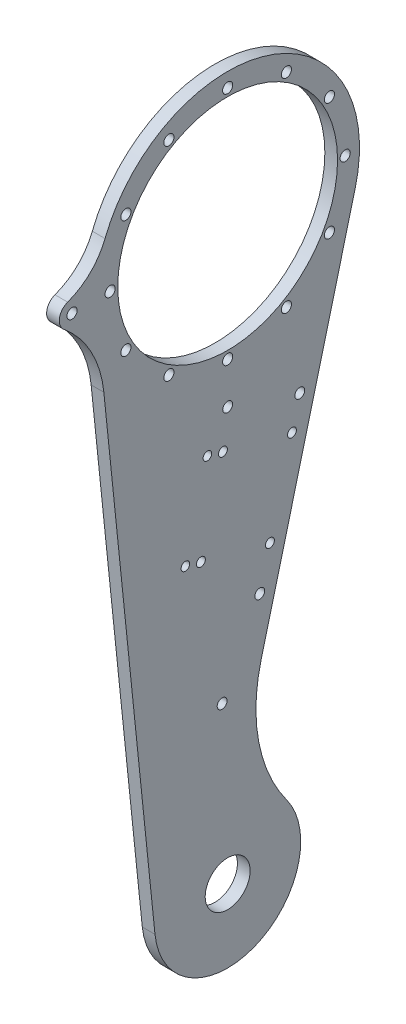
ISO-10303-21;
HEADER;
FILE_DESCRIPTION(('STEP AP214'),'2;1');
FILE_NAME('part.step','',(''),(''),'','','');
FILE_SCHEMA(('AUTOMOTIVE_DESIGN { 1 0 10303 214 1 1 1 1 }'));
ENDSEC;
DATA;
#1=APPLICATION_CONTEXT('core data for automotive mechanical design processes');
#2=APPLICATION_PROTOCOL_DEFINITION('international standard','automotive_design',2000,#1);
#3=PRODUCT_CONTEXT('',#1,'mechanical');
#4=PRODUCT('Part','Part','',(#3));
#5=PRODUCT_RELATED_PRODUCT_CATEGORY('part','',(#4));
#6=PRODUCT_DEFINITION_FORMATION('','',#4);
#7=PRODUCT_DEFINITION_CONTEXT('part definition',#1,'design');
#8=PRODUCT_DEFINITION('design','',#6,#7);
#9=PRODUCT_DEFINITION_SHAPE('','',#8);
#10=(LENGTH_UNIT() NAMED_UNIT(*) SI_UNIT(.MILLI.,.METRE.));
#11=(NAMED_UNIT(*) PLANE_ANGLE_UNIT() SI_UNIT($,.RADIAN.));
#12=(NAMED_UNIT(*) SI_UNIT($,.STERADIAN.) SOLID_ANGLE_UNIT());
#13=UNCERTAINTY_MEASURE_WITH_UNIT(LENGTH_MEASURE(1.E-05),#10,'distance_accuracy_value','');
#14=(GEOMETRIC_REPRESENTATION_CONTEXT(3) GLOBAL_UNCERTAINTY_ASSIGNED_CONTEXT((#13)) GLOBAL_UNIT_ASSIGNED_CONTEXT((#10,
#11,#12)) REPRESENTATION_CONTEXT('',''));
#15=CARTESIAN_POINT('',(0.,0.,0.));
#16=DIRECTION('',(0.,0.,1.));
#17=DIRECTION('',(1.,0.,0.));
#18=AXIS2_PLACEMENT_3D('',#15,#16,#17);
#19=CARTESIAN_POINT('',(4.,0.,0.));
#20=DIRECTION('',(-1.,0.,0.));
#21=DIRECTION('',(0.,0.,1.));
#22=AXIS2_PLACEMENT_3D('',#19,#20,#21);
#23=CYLINDRICAL_SURFACE('',#22,41.5);
#24=CARTESIAN_POINT('',(0.,0.,0.));
#25=DIRECTION('',(1.,0.,0.));
#26=DIRECTION('',(0.,0.,-1.));
#27=AXIS2_PLACEMENT_3D('',#24,#25,#26);
#28=CIRCLE('',#27,41.5);
#29=CARTESIAN_POINT('',(0.,-10.4614742427474,-40.1597753562982));
#30=VERTEX_POINT('',#29);
#31=CARTESIAN_POINT('',(0.,15.2163837891719,38.6097353575575));
#32=VERTEX_POINT('',#31);
#33=EDGE_CURVE('E128',#30,#32,#28,.T.);
#34=ORIENTED_EDGE('',*,*,#33,.T.);
#35=DIRECTION('',(-1.,0.,0.));
#36=VECTOR('',#35,1.);
#37=CARTESIAN_POINT('',(4.,15.2163837891719,38.6097353575575));
#38=LINE('',#37,#36);
#39=CARTESIAN_POINT('',(4.,15.2163837891719,38.6097353575575));
#40=VERTEX_POINT('',#39);
#41=EDGE_CURVE('E146',#32,#40,#38,.F.);
#42=ORIENTED_EDGE('',*,*,#41,.T.);
#43=CARTESIAN_POINT('',(4.,0.,0.));
#44=DIRECTION('',(1.,0.,0.));
#45=DIRECTION('',(0.,0.,-1.));
#46=AXIS2_PLACEMENT_3D('',#43,#44,#45);
#47=CIRCLE('',#46,41.5);
#48=CARTESIAN_POINT('',(4.,-10.4614742427474,-40.1597753562982));
#49=VERTEX_POINT('',#48);
#50=EDGE_CURVE('E107',#49,#40,#47,.T.);
#51=ORIENTED_EDGE('',*,*,#50,.F.);
#52=DIRECTION('',(-1.,0.,0.));
#53=VECTOR('',#52,1.);
#54=CARTESIAN_POINT('',(4.,-10.4614742427474,-40.1597753562982));
#55=LINE('',#54,#53);
#56=EDGE_CURVE('E117',#49,#30,#55,.T.);
#57=ORIENTED_EDGE('',*,*,#56,.T.);
#58=EDGE_LOOP('',(#34,#42,#51,#57));
#59=FACE_BOUND('',#58,.T.);
#60=ADVANCED_FACE('F36',(#59),#23,.T.);
#61=CARTESIAN_POINT('',(4.,-4.26527777777777,41.2802302013736));
#62=DIRECTION('',(0.,0.102777777777778,-0.994704342201773));
#63=DIRECTION('',(0.,0.994704342201773,0.102777777777778));
#64=AXIS2_PLACEMENT_3D('',#61,#62,#63);
#65=PLANE('',#64);
#66=DIRECTION('',(0.,-0.994704342201773,-0.102777777777778));
#67=VECTOR('',#66,1.);
#68=CARTESIAN_POINT('',(4.,-4.26527777777777,41.2802302013736));
#69=LINE('',#68,#67);
#70=CARTESIAN_POINT('',(4.,-26.5043971550649,38.982374273377));
#71=VERTEX_POINT('',#70);
#72=CARTESIAN_POINT('',(4.,-182.363888888889,22.8781998706408));
#73=VERTEX_POINT('',#72);
#74=EDGE_CURVE('E99',#71,#73,#69,.T.);
#75=ORIENTED_EDGE('',*,*,#74,.F.);
#76=DIRECTION('',(1.,0.,0.));
#77=VECTOR('',#76,1.);
#78=CARTESIAN_POINT('',(4.,-26.5043971550649,38.982374273377));
#79=LINE('',#78,#77);
#80=CARTESIAN_POINT('',(0.,-26.5043971550649,38.982374273377));
#81=VERTEX_POINT('',#80);
#82=EDGE_CURVE('E59',#71,#81,#79,.F.);
#83=ORIENTED_EDGE('',*,*,#82,.T.);
#84=DIRECTION('',(0.,-0.994704342201773,-0.102777777777778));
#85=VECTOR('',#84,1.);
#86=CARTESIAN_POINT('',(0.,-4.26527777777777,41.2802302013736));
#87=LINE('',#86,#85);
#88=CARTESIAN_POINT('',(0.,-182.363888888889,22.8781998706408));
#89=VERTEX_POINT('',#88);
#90=EDGE_CURVE('E112',#81,#89,#87,.T.);
#91=ORIENTED_EDGE('',*,*,#90,.T.);
#92=DIRECTION('',(-1.,0.,0.));
#93=VECTOR('',#92,1.);
#94=CARTESIAN_POINT('',(4.,-182.363888888889,22.8781998706408));
#95=LINE('',#94,#93);
#96=EDGE_CURVE('E110',#73,#89,#95,.T.);
#97=ORIENTED_EDGE('',*,*,#96,.F.);
#98=EDGE_LOOP('',(#75,#83,#91,#97));
#99=FACE_BOUND('',#98,.T.);
#100=ADVANCED_FACE('F111',(#99),#65,.F.);
#101=CARTESIAN_POINT('',(4.,-180.,0.));
#102=DIRECTION('',(-1.,0.,0.));
#103=DIRECTION('',(0.,0.,1.));
#104=AXIS2_PLACEMENT_3D('',#101,#102,#103);
#105=CYLINDRICAL_SURFACE('',#104,23.);
#106=CARTESIAN_POINT('',(0.,-180.,0.));
#107=DIRECTION('',(1.,0.,0.));
#108=DIRECTION('',(0.,0.,-1.));
#109=AXIS2_PLACEMENT_3D('',#106,#107,#108);
#110=CIRCLE('',#109,23.);
#111=CARTESIAN_POINT('',(0.,-166.412012387865,-18.5571170350483));
#112=VERTEX_POINT('',#111);
#113=EDGE_CURVE('E133',#89,#112,#110,.T.);
#114=ORIENTED_EDGE('',*,*,#113,.T.);
#115=DIRECTION('',(-1.,0.,0.));
#116=VECTOR('',#115,1.);
#117=CARTESIAN_POINT('',(4.,-166.412012387865,-18.5571170350483));
#118=LINE('',#117,#116);
#119=CARTESIAN_POINT('',(4.,-166.412012387865,-18.5571170350483));
#120=VERTEX_POINT('',#119);
#121=EDGE_CURVE('E121',#112,#120,#118,.F.);
#122=ORIENTED_EDGE('',*,*,#121,.T.);
#123=CARTESIAN_POINT('',(4.,-180.,0.));
#124=DIRECTION('',(1.,0.,0.));
#125=DIRECTION('',(0.,0.,-1.));
#126=AXIS2_PLACEMENT_3D('',#123,#124,#125);
#127=CIRCLE('',#126,23.);
#128=EDGE_CURVE('E105',#73,#120,#127,.T.);
#129=ORIENTED_EDGE('',*,*,#128,.F.);
#130=ORIENTED_EDGE('',*,*,#96,.T.);
#131=EDGE_LOOP('',(#114,#122,#129,#130));
#132=FACE_BOUND('',#131,.T.);
#133=ADVANCED_FACE('F119',(#132),#105,.T.);
#134=CARTESIAN_POINT('',(4.,-10.4614742427474,-40.1597753562982));
#135=DIRECTION('',(0.,-0.252083716692709,-0.967705430272245));
#136=DIRECTION('',(0.,0.967705430272245,-0.252083716692709));
#137=AXIS2_PLACEMENT_3D('',#134,#135,#136);
#138=PLANE('',#137);
#139=DIRECTION('',(0.,-0.967705430272245,0.252083716692709));
#140=VECTOR('',#139,1.);
#141=CARTESIAN_POINT('',(4.,-10.4614742427474,-40.1597753562982));
#142=LINE('',#141,#140);
#143=CARTESIAN_POINT('',(4.,-124.26872304859,-10.5134042932801));
#144=VERTEX_POINT('',#143);
#145=EDGE_CURVE('E122',#49,#144,#142,.T.);
#146=ORIENTED_EDGE('',*,*,#145,.T.);
#147=DIRECTION('',(-1.,0.,0.));
#148=VECTOR('',#147,1.);
#149=CARTESIAN_POINT('',(4.,-124.26872304859,-10.5134042932801));
#150=LINE('',#149,#148);
#151=CARTESIAN_POINT('',(0.,-124.26872304859,-10.5134042932801));
#152=VERTEX_POINT('',#151);
#153=EDGE_CURVE('E116',#144,#152,#150,.T.);
#154=ORIENTED_EDGE('',*,*,#153,.T.);
#155=DIRECTION('',(0.,-0.967705430272245,0.252083716692709));
#156=VECTOR('',#155,1.);
#157=CARTESIAN_POINT('',(0.,-10.4614742427474,-40.1597753562982));
#158=LINE('',#157,#156);
#159=EDGE_CURVE('E135',#30,#152,#158,.T.);
#160=ORIENTED_EDGE('',*,*,#159,.F.);
#161=ORIENTED_EDGE('',*,*,#56,.F.);
#162=EDGE_LOOP('',(#146,#154,#160,#161));
#163=FACE_BOUND('',#162,.T.);
#164=ADVANCED_FACE('F440',(#163),#138,.T.);
#165=CARTESIAN_POINT('',(4.,0.,0.));
#166=DIRECTION('',(1.,0.,0.));
#167=DIRECTION('',(0.,0.,-1.));
#168=AXIS2_PLACEMENT_3D('',#165,#166,#167);
#169=PLANE('',#168);
#170=CARTESIAN_POINT('',(4.,-60.1783105520546,6.37587843907637));
#171=DIRECTION('',(1.,0.,0.));
#172=DIRECTION('',(0.,0.,-1.));
#173=AXIS2_PLACEMENT_3D('',#170,#171,#172);
#174=CIRCLE('',#173,1.35);
#175=CARTESIAN_POINT('',(4.,-60.1783105520546,5.02587843907638));
#176=VERTEX_POINT('',#175);
#177=EDGE_CURVE('E191',#176,#176,#174,.T.);
#178=ORIENTED_EDGE('',*,*,#177,.F.);
#179=EDGE_LOOP('',(#178));
#180=FACE_BOUND('',#179,.T.);
#181=CARTESIAN_POINT('',(4.,-86.7902098845413,13.3081806481259));
#182=DIRECTION('',(1.,0.,0.));
#183=DIRECTION('',(0.,0.,-1.));
#184=AXIS2_PLACEMENT_3D('',#181,#182,#183);
#185=CIRCLE('',#184,1.35);
#186=CARTESIAN_POINT('',(4.,-86.7902098845413,11.9581806481259));
#187=VERTEX_POINT('',#186);
#188=EDGE_CURVE('E197',#187,#187,#185,.T.);
#189=ORIENTED_EDGE('',*,*,#188,.F.);
#190=EDGE_LOOP('',(#189));
#191=FACE_BOUND('',#190,.T.);
#192=CARTESIAN_POINT('',(4.,-67.110612761104,-20.2360208934104));
#193=DIRECTION('',(1.,0.,0.));
#194=DIRECTION('',(0.,0.,-1.));
#195=AXIS2_PLACEMENT_3D('',#192,#193,#194);
#196=CIRCLE('',#195,1.4);
#197=CARTESIAN_POINT('',(4.,-67.110612761104,-21.6360208934104));
#198=VERTEX_POINT('',#197);
#199=EDGE_CURVE('E180',#198,#198,#196,.T.);
#200=ORIENTED_EDGE('',*,*,#199,.F.);
#201=EDGE_LOOP('',(#200));
#202=FACE_BOUND('',#201,.T.);
#203=CARTESIAN_POINT('',(4.,-61.4501422522014,1.49353832297592));
#204=DIRECTION('',(1.,0.,0.));
#205=DIRECTION('',(0.,0.,-1.));
#206=AXIS2_PLACEMENT_3D('',#203,#204,#205);
#207=CIRCLE('',#206,1.4);
#208=CARTESIAN_POINT('',(4.,-61.4501422522014,0.0935383229759238));
#209=VERTEX_POINT('',#208);
#210=EDGE_CURVE('E206',#209,#209,#207,.T.);
#211=ORIENTED_EDGE('',*,*,#210,.F.);
#212=EDGE_LOOP('',(#211));
#213=FACE_BOUND('',#212,.T.);
#214=CARTESIAN_POINT('',(4.,-88.0620415846881,8.42584053202543));
#215=DIRECTION('',(1.,0.,0.));
#216=DIRECTION('',(0.,0.,-1.));
#217=AXIS2_PLACEMENT_3D('',#214,#215,#216);
#218=CIRCLE('',#217,1.4);
#219=CARTESIAN_POINT('',(4.,-88.0620415846881,7.02584053202543));
#220=VERTEX_POINT('',#219);
#221=EDGE_CURVE('E209',#220,#220,#218,.T.);
#222=ORIENTED_EDGE('',*,*,#221,.F.);
#223=EDGE_LOOP('',(#222));
#224=FACE_BOUND('',#223,.T.);
#225=CARTESIAN_POINT('',(4.,-93.7225120935908,-13.3037186843609));
#226=DIRECTION('',(1.,0.,0.));
#227=DIRECTION('',(0.,0.,-1.));
#228=AXIS2_PLACEMENT_3D('',#225,#226,#227);
#229=CIRCLE('',#228,1.4);
#230=CARTESIAN_POINT('',(4.,-93.7225120935908,-14.7037186843609));
#231=VERTEX_POINT('',#230);
#232=EDGE_CURVE('E195',#231,#231,#229,.T.);
#233=ORIENTED_EDGE('',*,*,#232,.F.);
#234=EDGE_LOOP('',(#233));
#235=FACE_BOUND('',#234,.T.);
#236=CARTESIAN_POINT('',(4.,-50.,0.));
#237=DIRECTION('',(1.,0.,0.));
#238=DIRECTION('',(0.,0.,-1.));
#239=AXIS2_PLACEMENT_3D('',#236,#237,#238);
#240=CIRCLE('',#239,1.55);
#241=CARTESIAN_POINT('',(4.,-50.,-1.55));
#242=VERTEX_POINT('',#241);
#243=EDGE_CURVE('E168',#242,#242,#240,.T.);
#244=ORIENTED_EDGE('',*,*,#243,.F.);
#245=EDGE_LOOP('',(#244));
#246=FACE_BOUND('',#245,.T.);
#247=CARTESIAN_POINT('',(4.,-130.,1.74603847458704));
#248=DIRECTION('',(1.,0.,0.));
#249=DIRECTION('',(0.,0.,-1.));
#250=AXIS2_PLACEMENT_3D('',#247,#248,#249);
#251=CIRCLE('',#250,1.54999999999999);
#252=CARTESIAN_POINT('',(4.,-130.,0.196038474587047));
#253=VERTEX_POINT('',#252);
#254=EDGE_CURVE('E188',#253,#253,#251,.T.);
#255=ORIENTED_EDGE('',*,*,#254,.F.);
#256=EDGE_LOOP('',(#255));
#257=FACE_BOUND('',#256,.T.);
#258=CARTESIAN_POINT('',(4.,-57.5863271728961,-22.7170623703015));
#259=DIRECTION('',(1.,0.,0.));
#260=DIRECTION('',(0.,0.,-1.));
#261=AXIS2_PLACEMENT_3D('',#258,#259,#260);
#262=CIRCLE('',#261,1.55);
#263=CARTESIAN_POINT('',(4.,-57.5863271728961,-24.2670623703015));
#264=VERTEX_POINT('',#263);
#265=EDGE_CURVE('E151',#264,#264,#262,.T.);
#266=ORIENTED_EDGE('',*,*,#265,.F.);
#267=EDGE_LOOP('',(#266));
#268=FACE_BOUND('',#267,.T.);
#269=CARTESIAN_POINT('',(4.,-105.971598686508,-10.1128765356661));
#270=DIRECTION('',(1.,0.,0.));
#271=DIRECTION('',(0.,0.,-1.));
#272=AXIS2_PLACEMENT_3D('',#269,#270,#271);
#273=CIRCLE('',#272,1.54999999999999);
#274=CARTESIAN_POINT('',(4.,-105.971598686508,-11.6628765356661));
#275=VERTEX_POINT('',#274);
#276=EDGE_CURVE('E225',#275,#275,#273,.T.);
#277=ORIENTED_EDGE('',*,*,#276,.F.);
#278=EDGE_LOOP('',(#277));
#279=FACE_BOUND('',#278,.T.);
#280=CARTESIAN_POINT('',(4.,18.4999999999999,-32.0429399400243));
#281=DIRECTION('',(1.,0.,0.));
#282=DIRECTION('',(0.,-0.86602540378444,-0.499999999999998));
#283=AXIS2_PLACEMENT_3D('',#280,#281,#282);
#284=CIRCLE('',#283,1.6);
#285=CARTESIAN_POINT('',(4.,17.1143593539448,-32.8429399400243));
#286=VERTEX_POINT('',#285);
#287=EDGE_CURVE('E245',#286,#286,#284,.T.);
#288=ORIENTED_EDGE('',*,*,#287,.F.);
#289=EDGE_LOOP('',(#288));
#290=FACE_BOUND('',#289,.T.);
#291=CARTESIAN_POINT('',(4.,-1.29200441052234E-13,-37.));
#292=DIRECTION('',(1.,0.,0.));
#293=DIRECTION('',(0.,-1.,0.));
#294=AXIS2_PLACEMENT_3D('',#291,#292,#293);
#295=CIRCLE('',#294,1.6);
#296=CARTESIAN_POINT('',(4.,-1.60000000000013,-37.));
#297=VERTEX_POINT('',#296);
#298=EDGE_CURVE('E253',#297,#297,#295,.T.);
#299=ORIENTED_EDGE('',*,*,#298,.F.);
#300=EDGE_LOOP('',(#299));
#301=FACE_BOUND('',#300,.T.);
#302=CARTESIAN_POINT('',(4.,-18.5000000000002,-32.0429399400241));
#303=DIRECTION('',(1.,0.,0.));
#304=DIRECTION('',(0.,-0.866025403784436,0.500000000000004));
#305=AXIS2_PLACEMENT_3D('',#302,#303,#304);
#306=CIRCLE('',#305,1.6);
#307=CARTESIAN_POINT('',(4.,-19.8856406460553,-31.2429399400241));
#308=VERTEX_POINT('',#307);
#309=EDGE_CURVE('E259',#308,#308,#306,.T.);
#310=ORIENTED_EDGE('',*,*,#309,.F.);
#311=EDGE_LOOP('',(#310));
#312=FACE_BOUND('',#311,.T.);
#313=CARTESIAN_POINT('',(4.,-32.0429399400243,-18.4999999999998));
#314=DIRECTION('',(1.,0.,0.));
#315=DIRECTION('',(0.,-0.499999999999995,0.866025403784442));
#316=AXIS2_PLACEMENT_3D('',#313,#314,#315);
#317=CIRCLE('',#316,1.6);
#318=CARTESIAN_POINT('',(4.,-32.8429399400243,-17.1143593539447));
#319=VERTEX_POINT('',#318);
#320=EDGE_CURVE('E265',#319,#319,#317,.T.);
#321=ORIENTED_EDGE('',*,*,#320,.F.);
#322=EDGE_LOOP('',(#321));
#323=FACE_BOUND('',#322,.T.);
#324=CARTESIAN_POINT('',(4.,-37.,0.));
#325=DIRECTION('',(1.,0.,0.));
#326=DIRECTION('',(0.,0.,1.));
#327=AXIS2_PLACEMENT_3D('',#324,#325,#326);
#328=CIRCLE('',#327,1.6);
#329=CARTESIAN_POINT('',(4.,-37.,1.6));
#330=VERTEX_POINT('',#329);
#331=EDGE_CURVE('E271',#330,#330,#328,.T.);
#332=ORIENTED_EDGE('',*,*,#331,.F.);
#333=EDGE_LOOP('',(#332));
#334=FACE_BOUND('',#333,.T.);
#335=CARTESIAN_POINT('',(4.,-32.0429399400241,18.5000000000003));
#336=DIRECTION('',(1.,0.,0.));
#337=DIRECTION('',(0.,0.500000000000007,0.866025403784435));
#338=AXIS2_PLACEMENT_3D('',#335,#336,#337);
#339=CIRCLE('',#338,1.6);
#340=CARTESIAN_POINT('',(4.,-31.2429399400241,19.8856406460554));
#341=VERTEX_POINT('',#340);
#342=EDGE_CURVE('E277',#341,#341,#339,.T.);
#343=ORIENTED_EDGE('',*,*,#342,.F.);
#344=EDGE_LOOP('',(#343));
#345=FACE_BOUND('',#344,.T.);
#346=CARTESIAN_POINT('',(4.,-18.4999999999997,32.0429399400244));
#347=DIRECTION('',(1.,0.,0.));
#348=DIRECTION('',(0.,0.866025403784443,0.499999999999992));
#349=AXIS2_PLACEMENT_3D('',#346,#347,#348);
#350=CIRCLE('',#349,1.6);
#351=CARTESIAN_POINT('',(4.,-17.1143593539446,32.8429399400244));
#352=VERTEX_POINT('',#351);
#353=EDGE_CURVE('E283',#352,#352,#350,.T.);
#354=ORIENTED_EDGE('',*,*,#353,.F.);
#355=EDGE_LOOP('',(#354));
#356=FACE_BOUND('',#355,.T.);
#357=CARTESIAN_POINT('',(4.,3.87570060126626E-13,37.));
#358=DIRECTION('',(1.,0.,0.));
#359=DIRECTION('',(0.,1.,0.));
#360=AXIS2_PLACEMENT_3D('',#357,#358,#359);
#361=CIRCLE('',#360,1.6);
#362=CARTESIAN_POINT('',(4.,1.60000000000039,37.));
#363=VERTEX_POINT('',#362);
#364=EDGE_CURVE('E240',#363,#363,#361,.T.);
#365=ORIENTED_EDGE('',*,*,#364,.F.);
#366=EDGE_LOOP('',(#365));
#367=FACE_BOUND('',#366,.T.);
#368=CARTESIAN_POINT('',(4.,18.5000000000004,32.042939940024));
#369=DIRECTION('',(1.,0.,0.));
#370=DIRECTION('',(0.,0.866025403784433,-0.50000000000001));
#371=AXIS2_PLACEMENT_3D('',#368,#369,#370);
#372=CIRCLE('',#371,1.6);
#373=CARTESIAN_POINT('',(4.,19.8856406460555,31.242939940024));
#374=VERTEX_POINT('',#373);
#375=EDGE_CURVE('E233',#374,#374,#372,.T.);
#376=ORIENTED_EDGE('',*,*,#375,.F.);
#377=EDGE_LOOP('',(#376));
#378=FACE_BOUND('',#377,.T.);
#379=CARTESIAN_POINT('',(4.,32.0429399400245,18.4999999999996));
#380=DIRECTION('',(1.,0.,0.));
#381=DIRECTION('',(0.,0.499999999999989,-0.866025403784445));
#382=AXIS2_PLACEMENT_3D('',#379,#380,#381);
#383=CIRCLE('',#382,1.6);
#384=CARTESIAN_POINT('',(4.,32.8429399400245,17.1143593539445));
#385=VERTEX_POINT('',#384);
#386=EDGE_CURVE('E154',#385,#385,#383,.T.);
#387=ORIENTED_EDGE('',*,*,#386,.F.);
#388=EDGE_LOOP('',(#387));
#389=FACE_BOUND('',#388,.T.);
#390=CARTESIAN_POINT('',(4.,32.0429399400242,-18.5));
#391=DIRECTION('',(1.,0.,0.));
#392=DIRECTION('',(0.,-0.500000000000001,-0.866025403784438));
#393=AXIS2_PLACEMENT_3D('',#390,#391,#392);
#394=CIRCLE('',#393,1.6);
#395=CARTESIAN_POINT('',(4.,31.2429399400242,-19.8856406460551));
#396=VERTEX_POINT('',#395);
#397=EDGE_CURVE('E252',#396,#396,#394,.T.);
#398=ORIENTED_EDGE('',*,*,#397,.F.);
#399=EDGE_LOOP('',(#398));
#400=FACE_BOUND('',#399,.T.);
#401=CARTESIAN_POINT('',(4.,37.,0.));
#402=DIRECTION('',(1.,0.,0.));
#403=DIRECTION('',(0.,0.,-1.));
#404=AXIS2_PLACEMENT_3D('',#401,#402,#403);
#405=CIRCLE('',#404,1.6);
#406=CARTESIAN_POINT('',(4.,37.,-1.6));
#407=VERTEX_POINT('',#406);
#408=EDGE_CURVE('E301',#407,#407,#405,.T.);
#409=ORIENTED_EDGE('',*,*,#408,.F.);
#410=EDGE_LOOP('',(#409));
#411=FACE_BOUND('',#410,.T.);
#412=CARTESIAN_POINT('',(4.,0.,0.));
#413=DIRECTION('',(1.,0.,0.));
#414=DIRECTION('',(0.,0.,-1.));
#415=AXIS2_PLACEMENT_3D('',#412,#413,#414);
#416=CIRCLE('',#415,34.6);
#417=CARTESIAN_POINT('',(4.,0.,-34.6));
#418=VERTEX_POINT('',#417);
#419=EDGE_CURVE('E131',#418,#418,#416,.T.);
#420=ORIENTED_EDGE('',*,*,#419,.F.);
#421=EDGE_LOOP('',(#420));
#422=FACE_BOUND('',#421,.T.);
#423=CARTESIAN_POINT('',(4.,-180.,0.));
#424=DIRECTION('',(1.,0.,0.));
#425=DIRECTION('',(0.,0.,-1.));
#426=AXIS2_PLACEMENT_3D('',#423,#424,#425);
#427=CIRCLE('',#426,7.075);
#428=CARTESIAN_POINT('',(4.,-180.,-7.075));
#429=VERTEX_POINT('',#428);
#430=EDGE_CURVE('E308',#429,#429,#427,.T.);
#431=ORIENTED_EDGE('',*,*,#430,.F.);
#432=EDGE_LOOP('',(#431));
#433=FACE_BOUND('',#432,.T.);
#434=ORIENTED_EDGE('',*,*,#50,.T.);
#435=CARTESIAN_POINT('',(4.,22.5495807960017,57.2168367346937));
#436=DIRECTION('',(1.,0.,0.));
#437=DIRECTION('',(0.,0.,-1.));
#438=AXIS2_PLACEMENT_3D('',#435,#436,#437);
#439=CIRCLE('',#438,20.);
#440=CARTESIAN_POINT('',(4.,3.75826346600058,50.3694727891157));
#441=VERTEX_POINT('',#440);
#442=EDGE_CURVE('E159',#40,#441,#439,.F.);
#443=ORIENTED_EDGE('',*,*,#442,.T.);
#444=CARTESIAN_POINT('',(4.,0.,49.));
#445=DIRECTION('',(1.,0.,0.));
#446=DIRECTION('',(0.,0.,-1.));
#447=AXIS2_PLACEMENT_3D('',#444,#445,#446);
#448=CIRCLE('',#447,4.00000000000039);
#449=CARTESIAN_POINT('',(4.,-3.08734557715792,51.543284743635));
#450=VERTEX_POINT('',#449);
#451=EDGE_CURVE('E171',#441,#450,#448,.T.);
#452=ORIENTED_EDGE('',*,*,#451,.T.);
#453=CARTESIAN_POINT('',(4.,-30.1016193772871,73.797026250439));
#454=DIRECTION('',(1.,0.,0.));
#455=DIRECTION('',(0.,0.,-1.));
#456=AXIS2_PLACEMENT_3D('',#453,#454,#455);
#457=CIRCLE('',#456,35.);
#458=EDGE_CURVE('E45',#450,#71,#457,.F.);
#459=ORIENTED_EDGE('',*,*,#458,.T.);
#460=ORIENTED_EDGE('',*,*,#74,.T.);
#461=ORIENTED_EDGE('',*,*,#128,.T.);
#462=CARTESIAN_POINT('',(4.,-136.872908883225,-58.8986758068923));
#463=DIRECTION('',(1.,0.,0.));
#464=DIRECTION('',(0.,0.,-1.));
#465=AXIS2_PLACEMENT_3D('',#462,#463,#464);
#466=CIRCLE('',#465,50.);
#467=EDGE_CURVE('E144',#120,#144,#466,.F.);
#468=ORIENTED_EDGE('',*,*,#467,.T.);
#469=ORIENTED_EDGE('',*,*,#145,.F.);
#470=EDGE_LOOP('',(#434,#443,#452,#459,#460,#461,#468,#469));
#471=FACE_BOUND('',#470,.T.);
#472=CARTESIAN_POINT('',(4.,0.,49.));
#473=DIRECTION('',(1.,0.,0.));
#474=DIRECTION('',(0.,0.,-1.));
#475=AXIS2_PLACEMENT_3D('',#472,#473,#474);
#476=CIRCLE('',#475,1.6);
#477=CARTESIAN_POINT('',(4.,0.,47.4));
#478=VERTEX_POINT('',#477);
#479=EDGE_CURVE('E222',#478,#478,#476,.T.);
#480=ORIENTED_EDGE('',*,*,#479,.F.);
#481=EDGE_LOOP('',(#480));
#482=FACE_BOUND('',#481,.T.);
#483=ADVANCED_FACE('F102',(#180,#191,#202,#213,#224,#235,#246,#257,#268,#279,#290,#301,#312,
#323,#334,#345,#356,#367,#378,#389,#400,#411,#422,#433,#471,#482),#169,.T.);
#484=CARTESIAN_POINT('',(0.,0.,0.));
#485=DIRECTION('',(1.,0.,0.));
#486=DIRECTION('',(0.,0.,-1.));
#487=AXIS2_PLACEMENT_3D('',#484,#485,#486);
#488=PLANE('',#487);
#489=CARTESIAN_POINT('',(0.,-60.1783105520546,6.37587843907637));
#490=DIRECTION('',(1.,0.,0.));
#491=DIRECTION('',(0.,0.,-1.));
#492=AXIS2_PLACEMENT_3D('',#489,#490,#491);
#493=CIRCLE('',#492,1.35);
#494=CARTESIAN_POINT('',(0.,-60.1783105520546,5.02587843907638));
#495=VERTEX_POINT('',#494);
#496=EDGE_CURVE('E40',#495,#495,#493,.T.);
#497=ORIENTED_EDGE('',*,*,#496,.T.);
#498=EDGE_LOOP('',(#497));
#499=FACE_BOUND('',#498,.T.);
#500=CARTESIAN_POINT('',(0.,-86.7902098845413,13.3081806481259));
#501=DIRECTION('',(1.,0.,0.));
#502=DIRECTION('',(0.,0.,-1.));
#503=AXIS2_PLACEMENT_3D('',#500,#501,#502);
#504=CIRCLE('',#503,1.35);
#505=CARTESIAN_POINT('',(0.,-86.7902098845413,11.9581806481259));
#506=VERTEX_POINT('',#505);
#507=EDGE_CURVE('E189',#506,#506,#504,.T.);
#508=ORIENTED_EDGE('',*,*,#507,.T.);
#509=EDGE_LOOP('',(#508));
#510=FACE_BOUND('',#509,.T.);
#511=CARTESIAN_POINT('',(0.,-67.110612761104,-20.2360208934104));
#512=DIRECTION('',(1.,0.,0.));
#513=DIRECTION('',(0.,0.,-1.));
#514=AXIS2_PLACEMENT_3D('',#511,#512,#513);
#515=CIRCLE('',#514,1.4);
#516=CARTESIAN_POINT('',(0.,-67.110612761104,-21.6360208934104));
#517=VERTEX_POINT('',#516);
#518=EDGE_CURVE('E186',#517,#517,#515,.T.);
#519=ORIENTED_EDGE('',*,*,#518,.T.);
#520=EDGE_LOOP('',(#519));
#521=FACE_BOUND('',#520,.T.);
#522=CARTESIAN_POINT('',(0.,-61.4501422522014,1.49353832297592));
#523=DIRECTION('',(1.,0.,0.));
#524=DIRECTION('',(0.,0.,-1.));
#525=AXIS2_PLACEMENT_3D('',#522,#523,#524);
#526=CIRCLE('',#525,1.4);
#527=CARTESIAN_POINT('',(0.,-61.4501422522014,0.0935383229759238));
#528=VERTEX_POINT('',#527);
#529=EDGE_CURVE('E183',#528,#528,#526,.T.);
#530=ORIENTED_EDGE('',*,*,#529,.T.);
#531=EDGE_LOOP('',(#530));
#532=FACE_BOUND('',#531,.T.);
#533=CARTESIAN_POINT('',(0.,-88.0620415846881,8.42584053202543));
#534=DIRECTION('',(1.,0.,0.));
#535=DIRECTION('',(0.,0.,-1.));
#536=AXIS2_PLACEMENT_3D('',#533,#534,#535);
#537=CIRCLE('',#536,1.4);
#538=CARTESIAN_POINT('',(0.,-88.0620415846881,7.02584053202543));
#539=VERTEX_POINT('',#538);
#540=EDGE_CURVE('E179',#539,#539,#537,.T.);
#541=ORIENTED_EDGE('',*,*,#540,.T.);
#542=EDGE_LOOP('',(#541));
#543=FACE_BOUND('',#542,.T.);
#544=CARTESIAN_POINT('',(0.,-93.7225120935908,-13.3037186843609));
#545=DIRECTION('',(1.,0.,0.));
#546=DIRECTION('',(0.,0.,-1.));
#547=AXIS2_PLACEMENT_3D('',#544,#545,#546);
#548=CIRCLE('',#547,1.4);
#549=CARTESIAN_POINT('',(0.,-93.7225120935908,-14.7037186843609));
#550=VERTEX_POINT('',#549);
#551=EDGE_CURVE('E176',#550,#550,#548,.T.);
#552=ORIENTED_EDGE('',*,*,#551,.T.);
#553=EDGE_LOOP('',(#552));
#554=FACE_BOUND('',#553,.T.);
#555=CARTESIAN_POINT('',(0.,-50.,0.));
#556=DIRECTION('',(1.,0.,0.));
#557=DIRECTION('',(0.,0.,-1.));
#558=AXIS2_PLACEMENT_3D('',#555,#556,#557);
#559=CIRCLE('',#558,1.55);
#560=CARTESIAN_POINT('',(0.,-50.,-1.55));
#561=VERTEX_POINT('',#560);
#562=EDGE_CURVE('E167',#561,#561,#559,.T.);
#563=ORIENTED_EDGE('',*,*,#562,.T.);
#564=EDGE_LOOP('',(#563));
#565=FACE_BOUND('',#564,.T.);
#566=CARTESIAN_POINT('',(0.,-130.,1.74603847458704));
#567=DIRECTION('',(1.,0.,0.));
#568=DIRECTION('',(0.,0.,-1.));
#569=AXIS2_PLACEMENT_3D('',#566,#567,#568);
#570=CIRCLE('',#569,1.54999999999999);
#571=CARTESIAN_POINT('',(0.,-130.,0.196038474587047));
#572=VERTEX_POINT('',#571);
#573=EDGE_CURVE('E164',#572,#572,#570,.T.);
#574=ORIENTED_EDGE('',*,*,#573,.T.);
#575=EDGE_LOOP('',(#574));
#576=FACE_BOUND('',#575,.T.);
#577=CARTESIAN_POINT('',(0.,-57.5863271728961,-22.7170623703015));
#578=DIRECTION('',(1.,0.,0.));
#579=DIRECTION('',(0.,0.,-1.));
#580=AXIS2_PLACEMENT_3D('',#577,#578,#579);
#581=CIRCLE('',#580,1.55);
#582=CARTESIAN_POINT('',(0.,-57.5863271728961,-24.2670623703015));
#583=VERTEX_POINT('',#582);
#584=EDGE_CURVE('E150',#583,#583,#581,.T.);
#585=ORIENTED_EDGE('',*,*,#584,.T.);
#586=EDGE_LOOP('',(#585));
#587=FACE_BOUND('',#586,.T.);
#588=CARTESIAN_POINT('',(0.,-105.971598686508,-10.1128765356661));
#589=DIRECTION('',(1.,0.,0.));
#590=DIRECTION('',(0.,0.,-1.));
#591=AXIS2_PLACEMENT_3D('',#588,#589,#590);
#592=CIRCLE('',#591,1.54999999999999);
#593=CARTESIAN_POINT('',(0.,-105.971598686508,-11.6628765356661));
#594=VERTEX_POINT('',#593);
#595=EDGE_CURVE('E147',#594,#594,#592,.T.);
#596=ORIENTED_EDGE('',*,*,#595,.T.);
#597=EDGE_LOOP('',(#596));
#598=FACE_BOUND('',#597,.T.);
#599=CARTESIAN_POINT('',(0.,18.4999999999999,-32.0429399400243));
#600=DIRECTION('',(-1.,0.,0.));
#601=DIRECTION('',(0.,0.86602540378444,0.499999999999998));
#602=AXIS2_PLACEMENT_3D('',#599,#600,#601);
#603=CIRCLE('',#602,1.6);
#604=CARTESIAN_POINT('',(0.,19.885640646055,-31.2429399400243));
#605=VERTEX_POINT('',#604);
#606=EDGE_CURVE('E248',#605,#605,#603,.T.);
#607=ORIENTED_EDGE('',*,*,#606,.F.);
#608=EDGE_LOOP('',(#607));
#609=FACE_BOUND('',#608,.T.);
#610=CARTESIAN_POINT('',(0.,-1.29200441052234E-13,-37.));
#611=DIRECTION('',(-1.,0.,0.));
#612=DIRECTION('',(0.,1.,0.));
#613=AXIS2_PLACEMENT_3D('',#610,#611,#612);
#614=CIRCLE('',#613,1.6);
#615=CARTESIAN_POINT('',(0.,1.59999999999987,-37.));
#616=VERTEX_POINT('',#615);
#617=EDGE_CURVE('E249',#616,#616,#614,.T.);
#618=ORIENTED_EDGE('',*,*,#617,.F.);
#619=EDGE_LOOP('',(#618));
#620=FACE_BOUND('',#619,.T.);
#621=CARTESIAN_POINT('',(0.,-18.5000000000002,-32.0429399400241));
#622=DIRECTION('',(-1.,0.,0.));
#623=DIRECTION('',(0.,0.866025403784436,-0.500000000000004));
#624=AXIS2_PLACEMENT_3D('',#621,#622,#623);
#625=CIRCLE('',#624,1.6);
#626=CARTESIAN_POINT('',(0.,-17.1143593539451,-32.8429399400242));
#627=VERTEX_POINT('',#626);
#628=EDGE_CURVE('E256',#627,#627,#625,.T.);
#629=ORIENTED_EDGE('',*,*,#628,.F.);
#630=EDGE_LOOP('',(#629));
#631=FACE_BOUND('',#630,.T.);
#632=CARTESIAN_POINT('',(0.,-32.0429399400243,-18.4999999999998));
#633=DIRECTION('',(-1.,0.,0.));
#634=DIRECTION('',(0.,0.499999999999995,-0.866025403784442));
#635=AXIS2_PLACEMENT_3D('',#632,#633,#634);
#636=CIRCLE('',#635,1.6);
#637=CARTESIAN_POINT('',(0.,-31.2429399400243,-19.8856406460549));
#638=VERTEX_POINT('',#637);
#639=EDGE_CURVE('E262',#638,#638,#636,.T.);
#640=ORIENTED_EDGE('',*,*,#639,.F.);
#641=EDGE_LOOP('',(#640));
#642=FACE_BOUND('',#641,.T.);
#643=CARTESIAN_POINT('',(0.,-37.,0.));
#644=DIRECTION('',(-1.,0.,0.));
#645=DIRECTION('',(0.,0.,-1.));
#646=AXIS2_PLACEMENT_3D('',#643,#644,#645);
#647=CIRCLE('',#646,1.6);
#648=CARTESIAN_POINT('',(0.,-37.,-1.6));
#649=VERTEX_POINT('',#648);
#650=EDGE_CURVE('E268',#649,#649,#647,.T.);
#651=ORIENTED_EDGE('',*,*,#650,.F.);
#652=EDGE_LOOP('',(#651));
#653=FACE_BOUND('',#652,.T.);
#654=CARTESIAN_POINT('',(0.,-32.0429399400241,18.5000000000003));
#655=DIRECTION('',(-1.,0.,0.));
#656=DIRECTION('',(0.,-0.500000000000007,-0.866025403784435));
#657=AXIS2_PLACEMENT_3D('',#654,#655,#656);
#658=CIRCLE('',#657,1.6);
#659=CARTESIAN_POINT('',(0.,-32.8429399400241,17.1143593539452));
#660=VERTEX_POINT('',#659);
#661=EDGE_CURVE('E274',#660,#660,#658,.T.);
#662=ORIENTED_EDGE('',*,*,#661,.F.);
#663=EDGE_LOOP('',(#662));
#664=FACE_BOUND('',#663,.T.);
#665=CARTESIAN_POINT('',(0.,-18.4999999999997,32.0429399400244));
#666=DIRECTION('',(-1.,0.,0.));
#667=DIRECTION('',(0.,-0.866025403784443,-0.499999999999992));
#668=AXIS2_PLACEMENT_3D('',#665,#666,#667);
#669=CIRCLE('',#668,1.6);
#670=CARTESIAN_POINT('',(0.,-19.8856406460548,31.2429399400244));
#671=VERTEX_POINT('',#670);
#672=EDGE_CURVE('E280',#671,#671,#669,.T.);
#673=ORIENTED_EDGE('',*,*,#672,.F.);
#674=EDGE_LOOP('',(#673));
#675=FACE_BOUND('',#674,.T.);
#676=CARTESIAN_POINT('',(0.,3.87570060126626E-13,37.));
#677=DIRECTION('',(-1.,0.,0.));
#678=DIRECTION('',(0.,-1.,0.));
#679=AXIS2_PLACEMENT_3D('',#676,#677,#678);
#680=CIRCLE('',#679,1.6);
#681=CARTESIAN_POINT('',(0.,-1.59999999999961,37.));
#682=VERTEX_POINT('',#681);
#683=EDGE_CURVE('E286',#682,#682,#680,.T.);
#684=ORIENTED_EDGE('',*,*,#683,.F.);
#685=EDGE_LOOP('',(#684));
#686=FACE_BOUND('',#685,.T.);
#687=CARTESIAN_POINT('',(0.,18.5000000000004,32.042939940024));
#688=DIRECTION('',(-1.,0.,0.));
#689=DIRECTION('',(0.,-0.866025403784433,0.50000000000001));
#690=AXIS2_PLACEMENT_3D('',#687,#688,#689);
#691=CIRCLE('',#690,1.6);
#692=CARTESIAN_POINT('',(0.,17.1143593539453,32.842939940024));
#693=VERTEX_POINT('',#692);
#694=EDGE_CURVE('E236',#693,#693,#691,.T.);
#695=ORIENTED_EDGE('',*,*,#694,.F.);
#696=EDGE_LOOP('',(#695));
#697=FACE_BOUND('',#696,.T.);
#698=CARTESIAN_POINT('',(0.,32.0429399400245,18.4999999999996));
#699=DIRECTION('',(-1.,0.,0.));
#700=DIRECTION('',(0.,-0.499999999999989,0.866025403784445));
#701=AXIS2_PLACEMENT_3D('',#698,#699,#700);
#702=CIRCLE('',#701,1.6);
#703=CARTESIAN_POINT('',(0.,31.2429399400245,19.8856406460547));
#704=VERTEX_POINT('',#703);
#705=EDGE_CURVE('E237',#704,#704,#702,.T.);
#706=ORIENTED_EDGE('',*,*,#705,.F.);
#707=EDGE_LOOP('',(#706));
#708=FACE_BOUND('',#707,.T.);
#709=CARTESIAN_POINT('',(0.,32.0429399400242,-18.5));
#710=DIRECTION('',(-1.,0.,0.));
#711=DIRECTION('',(0.,0.500000000000001,0.866025403784438));
#712=AXIS2_PLACEMENT_3D('',#709,#710,#711);
#713=CIRCLE('',#712,1.6);
#714=CARTESIAN_POINT('',(0.,32.8429399400242,-17.1143593539449));
#715=VERTEX_POINT('',#714);
#716=EDGE_CURVE('E295',#715,#715,#713,.T.);
#717=ORIENTED_EDGE('',*,*,#716,.F.);
#718=EDGE_LOOP('',(#717));
#719=FACE_BOUND('',#718,.T.);
#720=CARTESIAN_POINT('',(0.,37.,0.));
#721=DIRECTION('',(-1.,0.,0.));
#722=DIRECTION('',(0.,0.,1.));
#723=AXIS2_PLACEMENT_3D('',#720,#721,#722);
#724=CIRCLE('',#723,1.6);
#725=CARTESIAN_POINT('',(0.,37.,1.6));
#726=VERTEX_POINT('',#725);
#727=EDGE_CURVE('E298',#726,#726,#724,.T.);
#728=ORIENTED_EDGE('',*,*,#727,.F.);
#729=EDGE_LOOP('',(#728));
#730=FACE_BOUND('',#729,.T.);
#731=CARTESIAN_POINT('',(0.,0.,0.));
#732=DIRECTION('',(-1.,0.,0.));
#733=DIRECTION('',(0.,0.,1.));
#734=AXIS2_PLACEMENT_3D('',#731,#732,#733);
#735=CIRCLE('',#734,34.6);
#736=CARTESIAN_POINT('',(0.,0.,34.6));
#737=VERTEX_POINT('',#736);
#738=EDGE_CURVE('E305',#737,#737,#735,.T.);
#739=ORIENTED_EDGE('',*,*,#738,.F.);
#740=EDGE_LOOP('',(#739));
#741=FACE_BOUND('',#740,.T.);
#742=CARTESIAN_POINT('',(0.,-180.,0.));
#743=DIRECTION('',(-1.,0.,0.));
#744=DIRECTION('',(0.,0.,1.));
#745=AXIS2_PLACEMENT_3D('',#742,#743,#744);
#746=CIRCLE('',#745,7.075);
#747=CARTESIAN_POINT('',(0.,-180.,7.075));
#748=VERTEX_POINT('',#747);
#749=EDGE_CURVE('E304',#748,#748,#746,.T.);
#750=ORIENTED_EDGE('',*,*,#749,.F.);
#751=EDGE_LOOP('',(#750));
#752=FACE_BOUND('',#751,.T.);
#753=ORIENTED_EDGE('',*,*,#33,.F.);
#754=ORIENTED_EDGE('',*,*,#159,.T.);
#755=CARTESIAN_POINT('',(0.,-136.872908883225,-58.8986758068923));
#756=DIRECTION('',(1.,0.,0.));
#757=DIRECTION('',(0.,0.,-1.));
#758=AXIS2_PLACEMENT_3D('',#755,#756,#757);
#759=CIRCLE('',#758,50.);
#760=EDGE_CURVE('E142',#152,#112,#759,.T.);
#761=ORIENTED_EDGE('',*,*,#760,.T.);
#762=ORIENTED_EDGE('',*,*,#113,.F.);
#763=ORIENTED_EDGE('',*,*,#90,.F.);
#764=CARTESIAN_POINT('',(0.,-30.1016193772871,73.797026250439));
#765=DIRECTION('',(1.,0.,0.));
#766=DIRECTION('',(0.,0.,-1.));
#767=AXIS2_PLACEMENT_3D('',#764,#765,#766);
#768=CIRCLE('',#767,35.);
#769=CARTESIAN_POINT('',(0.,-3.08734557715792,51.543284743635));
#770=VERTEX_POINT('',#769);
#771=EDGE_CURVE('E11',#81,#770,#768,.T.);
#772=ORIENTED_EDGE('',*,*,#771,.T.);
#773=CARTESIAN_POINT('',(0.,0.,49.));
#774=DIRECTION('',(1.,0.,0.));
#775=DIRECTION('',(0.,0.,-1.));
#776=AXIS2_PLACEMENT_3D('',#773,#774,#775);
#777=CIRCLE('',#776,4.00000000000039);
#778=CARTESIAN_POINT('',(0.,3.75826346600058,50.3694727891157));
#779=VERTEX_POINT('',#778);
#780=EDGE_CURVE('E218',#779,#770,#777,.T.);
#781=ORIENTED_EDGE('',*,*,#780,.F.);
#782=CARTESIAN_POINT('',(0.,22.5495807960017,57.2168367346937));
#783=DIRECTION('',(1.,0.,0.));
#784=DIRECTION('',(0.,0.,-1.));
#785=AXIS2_PLACEMENT_3D('',#782,#783,#784);
#786=CIRCLE('',#785,20.);
#787=EDGE_CURVE('E161',#779,#32,#786,.T.);
#788=ORIENTED_EDGE('',*,*,#787,.T.);
#789=EDGE_LOOP('',(#753,#754,#761,#762,#763,#772,#781,#788));
#790=FACE_BOUND('',#789,.T.);
#791=CARTESIAN_POINT('',(0.,0.,49.));
#792=DIRECTION('',(1.,0.,0.));
#793=DIRECTION('',(0.,0.,-1.));
#794=AXIS2_PLACEMENT_3D('',#791,#792,#793);
#795=CIRCLE('',#794,1.6);
#796=CARTESIAN_POINT('',(0.,0.,47.4));
#797=VERTEX_POINT('',#796);
#798=EDGE_CURVE('E221',#797,#797,#795,.T.);
#799=ORIENTED_EDGE('',*,*,#798,.T.);
#800=EDGE_LOOP('',(#799));
#801=FACE_BOUND('',#800,.T.);
#802=ADVANCED_FACE('F329',(#499,#510,#521,#532,#543,#554,#565,#576,#587,#598,#609,#620,#631,
#642,#653,#664,#675,#686,#697,#708,#719,#730,#741,#752,#790,#801),#488,.F.);
#803=CARTESIAN_POINT('',(5.,-180.,0.));
#804=DIRECTION('',(-1.,0.,0.));
#805=DIRECTION('',(0.,0.,1.));
#806=AXIS2_PLACEMENT_3D('',#803,#804,#805);
#807=CYLINDRICAL_SURFACE('',#806,7.075);
#808=ORIENTED_EDGE('',*,*,#430,.T.);
#809=EDGE_LOOP('',(#808));
#810=FACE_BOUND('',#809,.T.);
#811=ORIENTED_EDGE('',*,*,#749,.T.);
#812=EDGE_LOOP('',(#811));
#813=FACE_BOUND('',#812,.T.);
#814=ADVANCED_FACE('F433',(#810,#813),#807,.F.);
#815=CARTESIAN_POINT('',(5.,0.,0.));
#816=DIRECTION('',(-1.,0.,0.));
#817=DIRECTION('',(0.,0.,1.));
#818=AXIS2_PLACEMENT_3D('',#815,#816,#817);
#819=CYLINDRICAL_SURFACE('',#818,34.6);
#820=ORIENTED_EDGE('',*,*,#419,.T.);
#821=EDGE_LOOP('',(#820));
#822=FACE_BOUND('',#821,.T.);
#823=ORIENTED_EDGE('',*,*,#738,.T.);
#824=EDGE_LOOP('',(#823));
#825=FACE_BOUND('',#824,.T.);
#826=ADVANCED_FACE('F429',(#822,#825),#819,.F.);
#827=CARTESIAN_POINT('',(5.,37.,0.));
#828=DIRECTION('',(-1.,0.,0.));
#829=DIRECTION('',(0.,0.,1.));
#830=AXIS2_PLACEMENT_3D('',#827,#828,#829);
#831=CYLINDRICAL_SURFACE('',#830,1.6);
#832=ORIENTED_EDGE('',*,*,#408,.T.);
#833=EDGE_LOOP('',(#832));
#834=FACE_BOUND('',#833,.T.);
#835=ORIENTED_EDGE('',*,*,#727,.T.);
#836=EDGE_LOOP('',(#835));
#837=FACE_BOUND('',#836,.T.);
#838=ADVANCED_FACE('F425',(#834,#837),#831,.F.);
#839=CARTESIAN_POINT('',(5.,32.0429399400242,-18.5));
#840=DIRECTION('',(-1.,0.,0.));
#841=DIRECTION('',(0.,0.500000000000001,0.866025403784438));
#842=AXIS2_PLACEMENT_3D('',#839,#840,#841);
#843=CYLINDRICAL_SURFACE('',#842,1.6);
#844=ORIENTED_EDGE('',*,*,#397,.T.);
#845=EDGE_LOOP('',(#844));
#846=FACE_BOUND('',#845,.T.);
#847=ORIENTED_EDGE('',*,*,#716,.T.);
#848=EDGE_LOOP('',(#847));
#849=FACE_BOUND('',#848,.T.);
#850=ADVANCED_FACE('F391',(#846,#849),#843,.F.);
#851=CARTESIAN_POINT('',(5.,32.0429399400245,18.4999999999996));
#852=DIRECTION('',(-1.,0.,0.));
#853=DIRECTION('',(0.,-0.499999999999989,0.866025403784445));
#854=AXIS2_PLACEMENT_3D('',#851,#852,#853);
#855=CYLINDRICAL_SURFACE('',#854,1.6);
#856=ORIENTED_EDGE('',*,*,#386,.T.);
#857=EDGE_LOOP('',(#856));
#858=FACE_BOUND('',#857,.T.);
#859=ORIENTED_EDGE('',*,*,#705,.T.);
#860=EDGE_LOOP('',(#859));
#861=FACE_BOUND('',#860,.T.);
#862=ADVANCED_FACE('F387',(#858,#861),#855,.F.);
#863=CARTESIAN_POINT('',(5.,18.5000000000004,32.042939940024));
#864=DIRECTION('',(-1.,0.,0.));
#865=DIRECTION('',(0.,-0.866025403784433,0.50000000000001));
#866=AXIS2_PLACEMENT_3D('',#863,#864,#865);
#867=CYLINDRICAL_SURFACE('',#866,1.6);
#868=ORIENTED_EDGE('',*,*,#375,.T.);
#869=EDGE_LOOP('',(#868));
#870=FACE_BOUND('',#869,.T.);
#871=ORIENTED_EDGE('',*,*,#694,.T.);
#872=EDGE_LOOP('',(#871));
#873=FACE_BOUND('',#872,.T.);
#874=ADVANCED_FACE('F383',(#870,#873),#867,.F.);
#875=CARTESIAN_POINT('',(5.,3.87570060126626E-13,37.));
#876=DIRECTION('',(-1.,0.,0.));
#877=DIRECTION('',(0.,-1.,0.));
#878=AXIS2_PLACEMENT_3D('',#875,#876,#877);
#879=CYLINDRICAL_SURFACE('',#878,1.6);
#880=ORIENTED_EDGE('',*,*,#364,.T.);
#881=EDGE_LOOP('',(#880));
#882=FACE_BOUND('',#881,.T.);
#883=ORIENTED_EDGE('',*,*,#683,.T.);
#884=EDGE_LOOP('',(#883));
#885=FACE_BOUND('',#884,.T.);
#886=ADVANCED_FACE('F386',(#882,#885),#879,.F.);
#887=CARTESIAN_POINT('',(5.,-18.4999999999997,32.0429399400244));
#888=DIRECTION('',(-1.,0.,0.));
#889=DIRECTION('',(0.,-0.866025403784443,-0.499999999999992));
#890=AXIS2_PLACEMENT_3D('',#887,#888,#889);
#891=CYLINDRICAL_SURFACE('',#890,1.6);
#892=ORIENTED_EDGE('',*,*,#353,.T.);
#893=EDGE_LOOP('',(#892));
#894=FACE_BOUND('',#893,.T.);
#895=ORIENTED_EDGE('',*,*,#672,.T.);
#896=EDGE_LOOP('',(#895));
#897=FACE_BOUND('',#896,.T.);
#898=ADVANCED_FACE('F415',(#894,#897),#891,.F.);
#899=CARTESIAN_POINT('',(5.,-32.0429399400241,18.5000000000003));
#900=DIRECTION('',(-1.,0.,0.));
#901=DIRECTION('',(0.,-0.500000000000007,-0.866025403784435));
#902=AXIS2_PLACEMENT_3D('',#899,#900,#901);
#903=CYLINDRICAL_SURFACE('',#902,1.6);
#904=ORIENTED_EDGE('',*,*,#342,.T.);
#905=EDGE_LOOP('',(#904));
#906=FACE_BOUND('',#905,.T.);
#907=ORIENTED_EDGE('',*,*,#661,.T.);
#908=EDGE_LOOP('',(#907));
#909=FACE_BOUND('',#908,.T.);
#910=ADVANCED_FACE('F411',(#906,#909),#903,.F.);
#911=CARTESIAN_POINT('',(5.,-37.,0.));
#912=DIRECTION('',(-1.,0.,0.));
#913=DIRECTION('',(0.,0.,-1.));
#914=AXIS2_PLACEMENT_3D('',#911,#912,#913);
#915=CYLINDRICAL_SURFACE('',#914,1.6);
#916=ORIENTED_EDGE('',*,*,#331,.T.);
#917=EDGE_LOOP('',(#916));
#918=FACE_BOUND('',#917,.T.);
#919=ORIENTED_EDGE('',*,*,#650,.T.);
#920=EDGE_LOOP('',(#919));
#921=FACE_BOUND('',#920,.T.);
#922=ADVANCED_FACE('F407',(#918,#921),#915,.F.);
#923=CARTESIAN_POINT('',(5.,-32.0429399400243,-18.4999999999998));
#924=DIRECTION('',(-1.,0.,0.));
#925=DIRECTION('',(0.,0.499999999999995,-0.866025403784442));
#926=AXIS2_PLACEMENT_3D('',#923,#924,#925);
#927=CYLINDRICAL_SURFACE('',#926,1.6);
#928=ORIENTED_EDGE('',*,*,#320,.T.);
#929=EDGE_LOOP('',(#928));
#930=FACE_BOUND('',#929,.T.);
#931=ORIENTED_EDGE('',*,*,#639,.T.);
#932=EDGE_LOOP('',(#931));
#933=FACE_BOUND('',#932,.T.);
#934=ADVANCED_FACE('F403',(#930,#933),#927,.F.);
#935=CARTESIAN_POINT('',(5.,-18.5000000000002,-32.0429399400241));
#936=DIRECTION('',(-1.,0.,0.));
#937=DIRECTION('',(0.,0.866025403784436,-0.500000000000004));
#938=AXIS2_PLACEMENT_3D('',#935,#936,#937);
#939=CYLINDRICAL_SURFACE('',#938,1.6);
#940=ORIENTED_EDGE('',*,*,#309,.T.);
#941=EDGE_LOOP('',(#940));
#942=FACE_BOUND('',#941,.T.);
#943=ORIENTED_EDGE('',*,*,#628,.T.);
#944=EDGE_LOOP('',(#943));
#945=FACE_BOUND('',#944,.T.);
#946=ADVANCED_FACE('F399',(#942,#945),#939,.F.);
#947=CARTESIAN_POINT('',(5.,-1.29200441052234E-13,-37.));
#948=DIRECTION('',(-1.,0.,0.));
#949=DIRECTION('',(0.,1.,0.));
#950=AXIS2_PLACEMENT_3D('',#947,#948,#949);
#951=CYLINDRICAL_SURFACE('',#950,1.6);
#952=ORIENTED_EDGE('',*,*,#298,.T.);
#953=EDGE_LOOP('',(#952));
#954=FACE_BOUND('',#953,.T.);
#955=ORIENTED_EDGE('',*,*,#617,.T.);
#956=EDGE_LOOP('',(#955));
#957=FACE_BOUND('',#956,.T.);
#958=ADVANCED_FACE('F395',(#954,#957),#951,.F.);
#959=CARTESIAN_POINT('',(5.,18.4999999999999,-32.0429399400243));
#960=DIRECTION('',(-1.,0.,0.));
#961=DIRECTION('',(0.,0.86602540378444,0.499999999999998));
#962=AXIS2_PLACEMENT_3D('',#959,#960,#961);
#963=CYLINDRICAL_SURFACE('',#962,1.6);
#964=ORIENTED_EDGE('',*,*,#287,.T.);
#965=EDGE_LOOP('',(#964));
#966=FACE_BOUND('',#965,.T.);
#967=ORIENTED_EDGE('',*,*,#606,.T.);
#968=EDGE_LOOP('',(#967));
#969=FACE_BOUND('',#968,.T.);
#970=ADVANCED_FACE('F357',(#966,#969),#963,.F.);
#971=CARTESIAN_POINT('',(4.,-136.872908883225,-58.8986758068923));
#972=DIRECTION('',(-1.,0.,0.));
#973=DIRECTION('',(0.,0.,1.));
#974=AXIS2_PLACEMENT_3D('',#971,#972,#973);
#975=CYLINDRICAL_SURFACE('',#974,50.);
#976=ORIENTED_EDGE('',*,*,#467,.F.);
#977=ORIENTED_EDGE('',*,*,#121,.F.);
#978=ORIENTED_EDGE('',*,*,#760,.F.);
#979=ORIENTED_EDGE('',*,*,#153,.F.);
#980=EDGE_LOOP('',(#976,#977,#978,#979));
#981=FACE_BOUND('',#980,.T.);
#982=ADVANCED_FACE('F354',(#981),#975,.F.);
#983=CARTESIAN_POINT('',(-6.,-105.971598686508,-10.1128765356661));
#984=DIRECTION('',(1.,0.,0.));
#985=DIRECTION('',(0.,0.,-1.));
#986=AXIS2_PLACEMENT_3D('',#983,#984,#985);
#987=CYLINDRICAL_SURFACE('',#986,1.54999999999999);
#988=ORIENTED_EDGE('',*,*,#276,.T.);
#989=EDGE_LOOP('',(#988));
#990=FACE_BOUND('',#989,.T.);
#991=ORIENTED_EDGE('',*,*,#595,.F.);
#992=EDGE_LOOP('',(#991));
#993=FACE_BOUND('',#992,.T.);
#994=ADVANCED_FACE('F356',(#990,#993),#987,.F.);
#995=CARTESIAN_POINT('',(-6.,-57.5863271728961,-22.7170623703015));
#996=DIRECTION('',(1.,0.,0.));
#997=DIRECTION('',(0.,0.,-1.));
#998=AXIS2_PLACEMENT_3D('',#995,#996,#997);
#999=CYLINDRICAL_SURFACE('',#998,1.55);
#1000=ORIENTED_EDGE('',*,*,#265,.T.);
#1001=EDGE_LOOP('',(#1000));
#1002=FACE_BOUND('',#1001,.T.);
#1003=ORIENTED_EDGE('',*,*,#584,.F.);
#1004=EDGE_LOOP('',(#1003));
#1005=FACE_BOUND('',#1004,.T.);
#1006=ADVANCED_FACE('F372',(#1002,#1005),#999,.F.);
#1007=CARTESIAN_POINT('',(0.,0.,49.));
#1008=DIRECTION('',(1.,0.,0.));
#1009=DIRECTION('',(0.,0.,-1.));
#1010=AXIS2_PLACEMENT_3D('',#1007,#1008,#1009);
#1011=CYLINDRICAL_SURFACE('',#1010,4.00000000000039);
#1012=ORIENTED_EDGE('',*,*,#780,.T.);
#1013=DIRECTION('',(1.,0.,0.));
#1014=VECTOR('',#1013,1.);
#1015=CARTESIAN_POINT('',(0.,-3.08734557715792,51.543284743635));
#1016=LINE('',#1015,#1014);
#1017=EDGE_CURVE('E163',#770,#450,#1016,.T.);
#1018=ORIENTED_EDGE('',*,*,#1017,.T.);
#1019=ORIENTED_EDGE('',*,*,#451,.F.);
#1020=DIRECTION('',(1.,0.,0.));
#1021=VECTOR('',#1020,1.);
#1022=CARTESIAN_POINT('',(0.,3.75826346600058,50.3694727891157));
#1023=LINE('',#1022,#1021);
#1024=EDGE_CURVE('E157',#441,#779,#1023,.F.);
#1025=ORIENTED_EDGE('',*,*,#1024,.T.);
#1026=EDGE_LOOP('',(#1012,#1018,#1019,#1025));
#1027=FACE_BOUND('',#1026,.T.);
#1028=ADVANCED_FACE('F326',(#1027),#1011,.T.);
#1029=CARTESIAN_POINT('',(0.,0.,49.));
#1030=DIRECTION('',(1.,0.,0.));
#1031=DIRECTION('',(0.,0.,-1.));
#1032=AXIS2_PLACEMENT_3D('',#1029,#1030,#1031);
#1033=CYLINDRICAL_SURFACE('',#1032,1.6);
#1034=ORIENTED_EDGE('',*,*,#798,.F.);
#1035=EDGE_LOOP('',(#1034));
#1036=FACE_BOUND('',#1035,.T.);
#1037=ORIENTED_EDGE('',*,*,#479,.T.);
#1038=EDGE_LOOP('',(#1037));
#1039=FACE_BOUND('',#1038,.T.);
#1040=ADVANCED_FACE('F360',(#1036,#1039),#1033,.F.);
#1041=CARTESIAN_POINT('',(0.,22.5495807960017,57.2168367346937));
#1042=DIRECTION('',(-1.,0.,0.));
#1043=DIRECTION('',(0.,0.,1.));
#1044=AXIS2_PLACEMENT_3D('',#1041,#1042,#1043);
#1045=CYLINDRICAL_SURFACE('',#1044,20.);
#1046=ORIENTED_EDGE('',*,*,#787,.F.);
#1047=ORIENTED_EDGE('',*,*,#1024,.F.);
#1048=ORIENTED_EDGE('',*,*,#442,.F.);
#1049=ORIENTED_EDGE('',*,*,#41,.F.);
#1050=EDGE_LOOP('',(#1046,#1047,#1048,#1049));
#1051=FACE_BOUND('',#1050,.T.);
#1052=ADVANCED_FACE('F322',(#1051),#1045,.F.);
#1053=CARTESIAN_POINT('',(-6.,-130.,1.74603847458704));
#1054=DIRECTION('',(1.,0.,0.));
#1055=DIRECTION('',(0.,0.,-1.));
#1056=AXIS2_PLACEMENT_3D('',#1053,#1054,#1055);
#1057=CYLINDRICAL_SURFACE('',#1056,1.54999999999999);
#1058=ORIENTED_EDGE('',*,*,#254,.T.);
#1059=EDGE_LOOP('',(#1058));
#1060=FACE_BOUND('',#1059,.T.);
#1061=ORIENTED_EDGE('',*,*,#573,.F.);
#1062=EDGE_LOOP('',(#1061));
#1063=FACE_BOUND('',#1062,.T.);
#1064=ADVANCED_FACE('F343',(#1060,#1063),#1057,.F.);
#1065=CARTESIAN_POINT('',(-6.,-50.,0.));
#1066=DIRECTION('',(1.,0.,0.));
#1067=DIRECTION('',(0.,0.,-1.));
#1068=AXIS2_PLACEMENT_3D('',#1065,#1066,#1067);
#1069=CYLINDRICAL_SURFACE('',#1068,1.55);
#1070=ORIENTED_EDGE('',*,*,#243,.T.);
#1071=EDGE_LOOP('',(#1070));
#1072=FACE_BOUND('',#1071,.T.);
#1073=ORIENTED_EDGE('',*,*,#562,.F.);
#1074=EDGE_LOOP('',(#1073));
#1075=FACE_BOUND('',#1074,.T.);
#1076=ADVANCED_FACE('F335',(#1072,#1075),#1069,.F.);
#1077=CARTESIAN_POINT('',(0.,-30.1016193772871,73.797026250439));
#1078=DIRECTION('',(1.,0.,0.));
#1079=DIRECTION('',(0.,0.,-1.));
#1080=AXIS2_PLACEMENT_3D('',#1077,#1078,#1079);
#1081=CYLINDRICAL_SURFACE('',#1080,35.);
#1082=ORIENTED_EDGE('',*,*,#771,.F.);
#1083=ORIENTED_EDGE('',*,*,#82,.F.);
#1084=ORIENTED_EDGE('',*,*,#458,.F.);
#1085=ORIENTED_EDGE('',*,*,#1017,.F.);
#1086=EDGE_LOOP('',(#1082,#1083,#1084,#1085));
#1087=FACE_BOUND('',#1086,.T.);
#1088=ADVANCED_FACE('F38',(#1087),#1081,.F.);
#1089=CARTESIAN_POINT('',(-6.,-93.7225120935908,-13.3037186843609));
#1090=DIRECTION('',(1.,0.,0.));
#1091=DIRECTION('',(0.,0.,-1.));
#1092=AXIS2_PLACEMENT_3D('',#1089,#1090,#1091);
#1093=CYLINDRICAL_SURFACE('',#1092,1.4);
#1094=ORIENTED_EDGE('',*,*,#232,.T.);
#1095=EDGE_LOOP('',(#1094));
#1096=FACE_BOUND('',#1095,.T.);
#1097=ORIENTED_EDGE('',*,*,#551,.F.);
#1098=EDGE_LOOP('',(#1097));
#1099=FACE_BOUND('',#1098,.T.);
#1100=ADVANCED_FACE('F334',(#1096,#1099),#1093,.F.);
#1101=CARTESIAN_POINT('',(-6.,-88.0620415846881,8.42584053202543));
#1102=DIRECTION('',(1.,0.,0.));
#1103=DIRECTION('',(0.,0.,-1.));
#1104=AXIS2_PLACEMENT_3D('',#1101,#1102,#1103);
#1105=CYLINDRICAL_SURFACE('',#1104,1.4);
#1106=ORIENTED_EDGE('',*,*,#221,.T.);
#1107=EDGE_LOOP('',(#1106));
#1108=FACE_BOUND('',#1107,.T.);
#1109=ORIENTED_EDGE('',*,*,#540,.F.);
#1110=EDGE_LOOP('',(#1109));
#1111=FACE_BOUND('',#1110,.T.);
#1112=ADVANCED_FACE('F340',(#1108,#1111),#1105,.F.);
#1113=CARTESIAN_POINT('',(-6.,-61.4501422522014,1.49353832297592));
#1114=DIRECTION('',(1.,0.,0.));
#1115=DIRECTION('',(0.,0.,-1.));
#1116=AXIS2_PLACEMENT_3D('',#1113,#1114,#1115);
#1117=CYLINDRICAL_SURFACE('',#1116,1.4);
#1118=ORIENTED_EDGE('',*,*,#210,.T.);
#1119=EDGE_LOOP('',(#1118));
#1120=FACE_BOUND('',#1119,.T.);
#1121=ORIENTED_EDGE('',*,*,#529,.F.);
#1122=EDGE_LOOP('',(#1121));
#1123=FACE_BOUND('',#1122,.T.);
#1124=ADVANCED_FACE('F562',(#1120,#1123),#1117,.F.);
#1125=CARTESIAN_POINT('',(-6.,-67.110612761104,-20.2360208934104));
#1126=DIRECTION('',(1.,0.,0.));
#1127=DIRECTION('',(0.,0.,-1.));
#1128=AXIS2_PLACEMENT_3D('',#1125,#1126,#1127);
#1129=CYLINDRICAL_SURFACE('',#1128,1.4);
#1130=ORIENTED_EDGE('',*,*,#199,.T.);
#1131=EDGE_LOOP('',(#1130));
#1132=FACE_BOUND('',#1131,.T.);
#1133=ORIENTED_EDGE('',*,*,#518,.F.);
#1134=EDGE_LOOP('',(#1133));
#1135=FACE_BOUND('',#1134,.T.);
#1136=ADVANCED_FACE('F571',(#1132,#1135),#1129,.F.);
#1137=CARTESIAN_POINT('',(-6.,-86.7902098845413,13.3081806481259));
#1138=DIRECTION('',(1.,0.,0.));
#1139=DIRECTION('',(0.,0.,-1.));
#1140=AXIS2_PLACEMENT_3D('',#1137,#1138,#1139);
#1141=CYLINDRICAL_SURFACE('',#1140,1.35);
#1142=ORIENTED_EDGE('',*,*,#188,.T.);
#1143=EDGE_LOOP('',(#1142));
#1144=FACE_BOUND('',#1143,.T.);
#1145=ORIENTED_EDGE('',*,*,#507,.F.);
#1146=EDGE_LOOP('',(#1145));
#1147=FACE_BOUND('',#1146,.T.);
#1148=ADVANCED_FACE('F580',(#1144,#1147),#1141,.F.);
#1149=CARTESIAN_POINT('',(-6.,-60.1783105520546,6.37587843907637));
#1150=DIRECTION('',(1.,0.,0.));
#1151=DIRECTION('',(0.,0.,-1.));
#1152=AXIS2_PLACEMENT_3D('',#1149,#1150,#1151);
#1153=CYLINDRICAL_SURFACE('',#1152,1.35);
#1154=ORIENTED_EDGE('',*,*,#177,.T.);
#1155=EDGE_LOOP('',(#1154));
#1156=FACE_BOUND('',#1155,.T.);
#1157=ORIENTED_EDGE('',*,*,#496,.F.);
#1158=EDGE_LOOP('',(#1157));
#1159=FACE_BOUND('',#1158,.T.);
#1160=ADVANCED_FACE('F590',(#1156,#1159),#1153,.F.);
#1161=CLOSED_SHELL('',(#60,#100,#133,#164,#483,#802,#814,#826,#838,#850,#862,#874,#886,#898,
#910,#922,#934,#946,#958,#970,#982,#994,#1006,#1028,#1040,#1052,#1064,#1076,#1088,#1100,#1112,
#1124,#1136,#1148,#1160));
#1162=MANIFOLD_SOLID_BREP('B2',#1161);
#1163=ADVANCED_BREP_SHAPE_REPRESENTATION('',(#18,#1162),#14);
#1164=SHAPE_DEFINITION_REPRESENTATION(#9,#1163);
ENDSEC;
END-ISO-10303-21;
